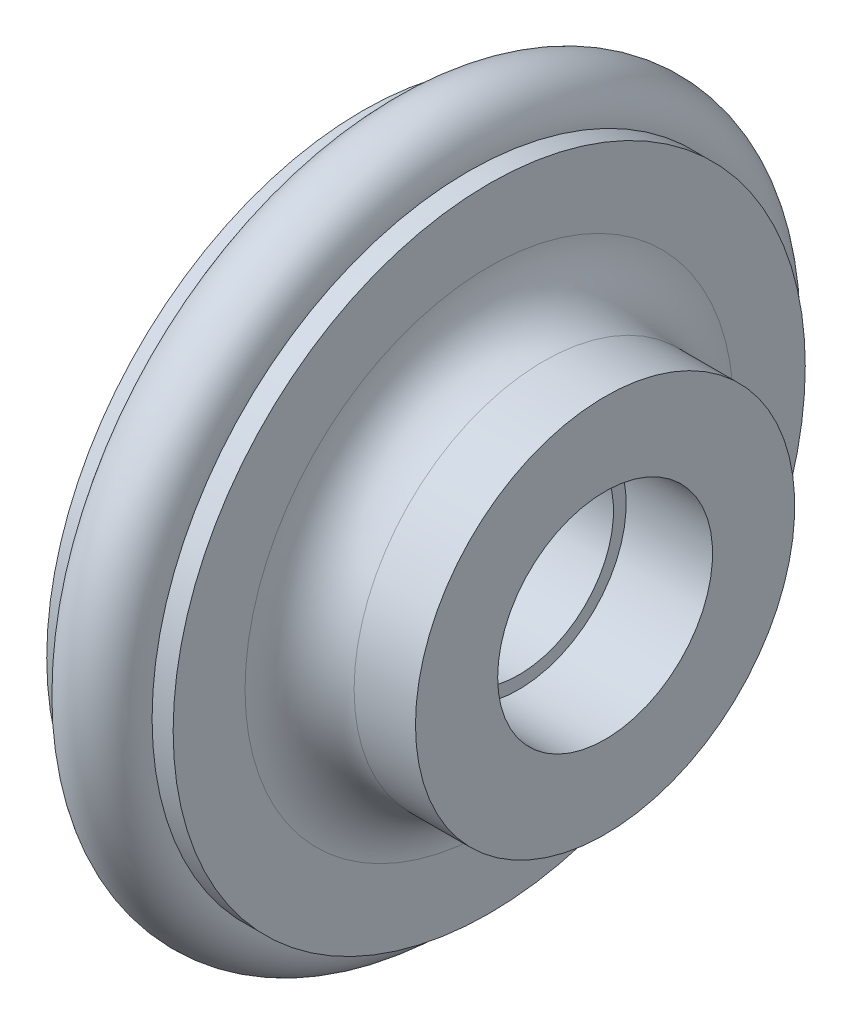
ISO-10303-21;
HEADER;
FILE_DESCRIPTION(('STEP AP214'),'2;1');
FILE_NAME('part.step','',(''),(''),'','','');
FILE_SCHEMA(('AUTOMOTIVE_DESIGN { 1 0 10303 214 1 1 1 1 }'));
ENDSEC;
DATA;
#1=APPLICATION_CONTEXT('core data for automotive mechanical design processes');
#2=APPLICATION_PROTOCOL_DEFINITION('international standard','automotive_design',2000,#1);
#3=PRODUCT_CONTEXT('',#1,'mechanical');
#4=PRODUCT('Part','Part','',(#3));
#5=PRODUCT_RELATED_PRODUCT_CATEGORY('part','',(#4));
#6=PRODUCT_DEFINITION_FORMATION('','',#4);
#7=PRODUCT_DEFINITION_CONTEXT('part definition',#1,'design');
#8=PRODUCT_DEFINITION('design','',#6,#7);
#9=PRODUCT_DEFINITION_SHAPE('','',#8);
#10=(LENGTH_UNIT() NAMED_UNIT(*) SI_UNIT(.MILLI.,.METRE.));
#11=(NAMED_UNIT(*) PLANE_ANGLE_UNIT() SI_UNIT($,.RADIAN.));
#12=(NAMED_UNIT(*) SI_UNIT($,.STERADIAN.) SOLID_ANGLE_UNIT());
#13=UNCERTAINTY_MEASURE_WITH_UNIT(LENGTH_MEASURE(1.E-05),#10,'distance_accuracy_value','');
#14=(GEOMETRIC_REPRESENTATION_CONTEXT(3) GLOBAL_UNCERTAINTY_ASSIGNED_CONTEXT((#13)) GLOBAL_UNIT_ASSIGNED_CONTEXT((#10,
#11,#12)) REPRESENTATION_CONTEXT('',''));
#15=CARTESIAN_POINT('',(0.,0.,0.));
#16=DIRECTION('',(0.,0.,1.));
#17=DIRECTION('',(1.,0.,0.));
#18=AXIS2_PLACEMENT_3D('',#15,#16,#17);
#19=CARTESIAN_POINT('',(0.,0.,0.));
#20=DIRECTION('',(-1.,0.,0.));
#21=DIRECTION('',(0.,0.,1.));
#22=AXIS2_PLACEMENT_3D('',#19,#20,#21);
#23=TOROIDAL_SURFACE('',#22,15.,1.95);
#24=CARTESIAN_POINT('',(0.,0.,16.95));
#25=VERTEX_POINT('',#24);
#26=VERTEX_LOOP('',#25);
#27=FACE_BOUND('',#26,.T.);
#28=ADVANCED_FACE('F41',(#27),#23,.T.);
#29=CLOSED_SHELL('',(#28));
#30=MANIFOLD_SOLID_BREP('B2',#29);
#31=CARTESIAN_POINT('',(0.,0.,0.));
#32=DIRECTION('',(-1.,0.,0.));
#33=DIRECTION('',(0.,0.,1.));
#34=AXIS2_PLACEMENT_3D('',#31,#32,#33);
#35=TOROIDAL_SURFACE('',#34,15.,2.);
#36=CARTESIAN_POINT('',(-2.,0.,0.));
#37=DIRECTION('',(-1.,0.,0.));
#38=DIRECTION('',(0.,0.,1.));
#39=AXIS2_PLACEMENT_3D('',#36,#37,#38);
#40=CIRCLE('',#39,15.);
#41=CARTESIAN_POINT('',(-2.,0.,15.));
#42=VERTEX_POINT('',#41);
#43=EDGE_CURVE('E40',#42,#42,#40,.T.);
#44=ORIENTED_EDGE('',*,*,#43,.F.);
#45=EDGE_LOOP('',(#44));
#46=FACE_BOUND('',#45,.T.);
#47=CARTESIAN_POINT('',(2.,0.,0.));
#48=DIRECTION('',(-1.,0.,0.));
#49=DIRECTION('',(0.,0.,1.));
#50=AXIS2_PLACEMENT_3D('',#47,#48,#49);
#51=CIRCLE('',#50,15.);
#52=CARTESIAN_POINT('',(2.,0.,15.));
#53=VERTEX_POINT('',#52);
#54=EDGE_CURVE('E99',#53,#53,#51,.T.);
#55=ORIENTED_EDGE('',*,*,#54,.T.);
#56=EDGE_LOOP('',(#55));
#57=FACE_BOUND('',#56,.T.);
#58=ADVANCED_FACE('F56',(#46,#57),#35,.F.);
#59=CARTESIAN_POINT('',(0.,0.,0.));
#60=DIRECTION('',(-1.,0.,0.));
#61=DIRECTION('',(0.,0.,1.));
#62=AXIS2_PLACEMENT_3D('',#59,#60,#61);
#63=CYLINDRICAL_SURFACE('',#62,15.);
#64=CARTESIAN_POINT('',(-3.,0.,0.));
#65=DIRECTION('',(-1.,0.,0.));
#66=DIRECTION('',(0.,0.,1.));
#67=AXIS2_PLACEMENT_3D('',#64,#65,#66);
#68=CIRCLE('',#67,15.);
#69=CARTESIAN_POINT('',(-3.,0.,15.));
#70=VERTEX_POINT('',#69);
#71=EDGE_CURVE('E62',#70,#70,#68,.T.);
#72=ORIENTED_EDGE('',*,*,#71,.F.);
#73=EDGE_LOOP('',(#72));
#74=FACE_BOUND('',#73,.T.);
#75=ORIENTED_EDGE('',*,*,#43,.T.);
#76=EDGE_LOOP('',(#75));
#77=FACE_BOUND('',#76,.T.);
#78=ADVANCED_FACE('F166',(#74,#77),#63,.T.);
#79=CARTESIAN_POINT('',(-3.,15.,0.));
#80=DIRECTION('',(1.,0.,0.));
#81=DIRECTION('',(0.,0.,-1.));
#82=AXIS2_PLACEMENT_3D('',#79,#80,#81);
#83=PLANE('',#82);
#84=CARTESIAN_POINT('',(-3.,0.,0.));
#85=DIRECTION('',(-1.,0.,0.));
#86=DIRECTION('',(0.,0.,1.));
#87=AXIS2_PLACEMENT_3D('',#84,#85,#86);
#88=CIRCLE('',#87,5.1);
#89=CARTESIAN_POINT('',(-3.,0.,5.1));
#90=VERTEX_POINT('',#89);
#91=EDGE_CURVE('E66',#90,#90,#88,.T.);
#92=ORIENTED_EDGE('',*,*,#91,.F.);
#93=EDGE_LOOP('',(#92));
#94=FACE_BOUND('',#93,.T.);
#95=ORIENTED_EDGE('',*,*,#71,.T.);
#96=EDGE_LOOP('',(#95));
#97=FACE_BOUND('',#96,.T.);
#98=ADVANCED_FACE('F161',(#94,#97),#83,.F.);
#99=CARTESIAN_POINT('',(0.,0.,0.));
#100=DIRECTION('',(-1.,0.,0.));
#101=DIRECTION('',(0.,0.,1.));
#102=AXIS2_PLACEMENT_3D('',#99,#100,#101);
#103=CYLINDRICAL_SURFACE('',#102,5.1);
#104=CARTESIAN_POINT('',(1.1,0.,0.));
#105=DIRECTION('',(-1.,0.,0.));
#106=DIRECTION('',(0.,0.,1.));
#107=AXIS2_PLACEMENT_3D('',#104,#105,#106);
#108=CIRCLE('',#107,5.1);
#109=CARTESIAN_POINT('',(1.1,0.,5.1));
#110=VERTEX_POINT('',#109);
#111=EDGE_CURVE('E70',#110,#110,#108,.T.);
#112=ORIENTED_EDGE('',*,*,#111,.F.);
#113=EDGE_LOOP('',(#112));
#114=FACE_BOUND('',#113,.T.);
#115=ORIENTED_EDGE('',*,*,#91,.T.);
#116=EDGE_LOOP('',(#115));
#117=FACE_BOUND('',#116,.T.);
#118=ADVANCED_FACE('F155',(#114,#117),#103,.F.);
#119=CARTESIAN_POINT('',(1.1,5.1,0.));
#120=DIRECTION('',(1.,0.,0.));
#121=DIRECTION('',(0.,0.,-1.));
#122=AXIS2_PLACEMENT_3D('',#119,#120,#121);
#123=PLANE('',#122);
#124=CARTESIAN_POINT('',(1.1,0.,0.));
#125=DIRECTION('',(-1.,0.,0.));
#126=DIRECTION('',(0.,0.,1.));
#127=AXIS2_PLACEMENT_3D('',#124,#125,#126);
#128=CIRCLE('',#127,4.5);
#129=CARTESIAN_POINT('',(1.1,0.,4.5));
#130=VERTEX_POINT('',#129);
#131=EDGE_CURVE('E75',#130,#130,#128,.T.);
#132=ORIENTED_EDGE('',*,*,#131,.F.);
#133=EDGE_LOOP('',(#132));
#134=FACE_BOUND('',#133,.T.);
#135=ORIENTED_EDGE('',*,*,#111,.T.);
#136=EDGE_LOOP('',(#135));
#137=FACE_BOUND('',#136,.T.);
#138=ADVANCED_FACE('F149',(#134,#137),#123,.F.);
#139=CARTESIAN_POINT('',(0.,0.,0.));
#140=DIRECTION('',(-1.,0.,0.));
#141=DIRECTION('',(0.,0.,1.));
#142=AXIS2_PLACEMENT_3D('',#139,#140,#141);
#143=CYLINDRICAL_SURFACE('',#142,4.5);
#144=CARTESIAN_POINT('',(4.4,0.,0.));
#145=DIRECTION('',(-1.,0.,0.));
#146=DIRECTION('',(0.,0.,1.));
#147=AXIS2_PLACEMENT_3D('',#144,#145,#146);
#148=CIRCLE('',#147,4.5);
#149=CARTESIAN_POINT('',(4.4,0.,4.5));
#150=VERTEX_POINT('',#149);
#151=EDGE_CURVE('E78',#150,#150,#148,.T.);
#152=ORIENTED_EDGE('',*,*,#151,.F.);
#153=EDGE_LOOP('',(#152));
#154=FACE_BOUND('',#153,.T.);
#155=ORIENTED_EDGE('',*,*,#131,.T.);
#156=EDGE_LOOP('',(#155));
#157=FACE_BOUND('',#156,.T.);
#158=ADVANCED_FACE('F143',(#154,#157),#143,.F.);
#159=CARTESIAN_POINT('',(4.4,5.1,0.));
#160=DIRECTION('',(-1.,0.,0.));
#161=DIRECTION('',(0.,0.,1.));
#162=AXIS2_PLACEMENT_3D('',#159,#160,#161);
#163=PLANE('',#162);
#164=CARTESIAN_POINT('',(4.4,0.,0.));
#165=DIRECTION('',(-1.,0.,0.));
#166=DIRECTION('',(0.,0.,1.));
#167=AXIS2_PLACEMENT_3D('',#164,#165,#166);
#168=CIRCLE('',#167,5.1);
#169=CARTESIAN_POINT('',(4.4,0.,5.1));
#170=VERTEX_POINT('',#169);
#171=EDGE_CURVE('E81',#170,#170,#168,.T.);
#172=ORIENTED_EDGE('',*,*,#171,.F.);
#173=EDGE_LOOP('',(#172));
#174=FACE_BOUND('',#173,.T.);
#175=ORIENTED_EDGE('',*,*,#151,.T.);
#176=EDGE_LOOP('',(#175));
#177=FACE_BOUND('',#176,.T.);
#178=ADVANCED_FACE('F137',(#174,#177),#163,.F.);
#179=CARTESIAN_POINT('',(0.,0.,0.));
#180=DIRECTION('',(-1.,0.,0.));
#181=DIRECTION('',(0.,0.,1.));
#182=AXIS2_PLACEMENT_3D('',#179,#180,#181);
#183=CYLINDRICAL_SURFACE('',#182,5.1);
#184=CARTESIAN_POINT('',(8.5,0.,0.));
#185=DIRECTION('',(-1.,0.,0.));
#186=DIRECTION('',(0.,0.,1.));
#187=AXIS2_PLACEMENT_3D('',#184,#185,#186);
#188=CIRCLE('',#187,5.1);
#189=CARTESIAN_POINT('',(8.5,0.,5.1));
#190=VERTEX_POINT('',#189);
#191=EDGE_CURVE('E84',#190,#190,#188,.T.);
#192=ORIENTED_EDGE('',*,*,#191,.F.);
#193=EDGE_LOOP('',(#192));
#194=FACE_BOUND('',#193,.T.);
#195=ORIENTED_EDGE('',*,*,#171,.T.);
#196=EDGE_LOOP('',(#195));
#197=FACE_BOUND('',#196,.T.);
#198=ADVANCED_FACE('F131',(#194,#197),#183,.F.);
#199=CARTESIAN_POINT('',(8.5,9.,0.));
#200=DIRECTION('',(-1.,0.,0.));
#201=DIRECTION('',(0.,0.,1.));
#202=AXIS2_PLACEMENT_3D('',#199,#200,#201);
#203=PLANE('',#202);
#204=CARTESIAN_POINT('',(8.5,0.,0.));
#205=DIRECTION('',(-1.,0.,0.));
#206=DIRECTION('',(0.,0.,1.));
#207=AXIS2_PLACEMENT_3D('',#204,#205,#206);
#208=CIRCLE('',#207,9.);
#209=CARTESIAN_POINT('',(8.5,0.,9.));
#210=VERTEX_POINT('',#209);
#211=EDGE_CURVE('E87',#210,#210,#208,.T.);
#212=ORIENTED_EDGE('',*,*,#211,.F.);
#213=EDGE_LOOP('',(#212));
#214=FACE_BOUND('',#213,.T.);
#215=ORIENTED_EDGE('',*,*,#191,.T.);
#216=EDGE_LOOP('',(#215));
#217=FACE_BOUND('',#216,.T.);
#218=ADVANCED_FACE('F125',(#214,#217),#203,.F.);
#219=CARTESIAN_POINT('',(0.,0.,0.));
#220=DIRECTION('',(-1.,0.,0.));
#221=DIRECTION('',(0.,0.,1.));
#222=AXIS2_PLACEMENT_3D('',#219,#220,#221);
#223=CYLINDRICAL_SURFACE('',#222,9.);
#224=CARTESIAN_POINT('',(5.58796448278056,0.,0.));
#225=DIRECTION('',(-1.,0.,0.));
#226=DIRECTION('',(0.,0.,1.));
#227=AXIS2_PLACEMENT_3D('',#224,#225,#226);
#228=CIRCLE('',#227,9.);
#229=CARTESIAN_POINT('',(5.58796448278056,0.,9.));
#230=VERTEX_POINT('',#229);
#231=EDGE_CURVE('E90',#230,#230,#228,.T.);
#232=ORIENTED_EDGE('',*,*,#231,.F.);
#233=EDGE_LOOP('',(#232));
#234=FACE_BOUND('',#233,.T.);
#235=ORIENTED_EDGE('',*,*,#211,.T.);
#236=EDGE_LOOP('',(#235));
#237=FACE_BOUND('',#236,.T.);
#238=ADVANCED_FACE('F119',(#234,#237),#223,.T.);
#239=CARTESIAN_POINT('',(5.58796448278056,0.,0.));
#240=DIRECTION('',(-1.,0.,0.));
#241=DIRECTION('',(0.,0.,1.));
#242=AXIS2_PLACEMENT_3D('',#239,#240,#241);
#243=TOROIDAL_SURFACE('',#242,11.5879644827806,2.58796448278056);
#244=CARTESIAN_POINT('',(3.,0.,0.));
#245=DIRECTION('',(-1.,0.,0.));
#246=DIRECTION('',(0.,0.,1.));
#247=AXIS2_PLACEMENT_3D('',#244,#245,#246);
#248=CIRCLE('',#247,11.5879644827806);
#249=CARTESIAN_POINT('',(3.,0.,11.5879644827806));
#250=VERTEX_POINT('',#249);
#251=EDGE_CURVE('E93',#250,#250,#248,.T.);
#252=ORIENTED_EDGE('',*,*,#251,.F.);
#253=EDGE_LOOP('',(#252));
#254=FACE_BOUND('',#253,.T.);
#255=ORIENTED_EDGE('',*,*,#231,.T.);
#256=EDGE_LOOP('',(#255));
#257=FACE_BOUND('',#256,.T.);
#258=ADVANCED_FACE('F113',(#254,#257),#243,.F.);
#259=CARTESIAN_POINT('',(3.,15.,0.));
#260=DIRECTION('',(-1.,0.,0.));
#261=DIRECTION('',(0.,0.,1.));
#262=AXIS2_PLACEMENT_3D('',#259,#260,#261);
#263=PLANE('',#262);
#264=CARTESIAN_POINT('',(3.,0.,0.));
#265=DIRECTION('',(-1.,0.,0.));
#266=DIRECTION('',(0.,0.,1.));
#267=AXIS2_PLACEMENT_3D('',#264,#265,#266);
#268=CIRCLE('',#267,15.);
#269=CARTESIAN_POINT('',(3.,0.,15.));
#270=VERTEX_POINT('',#269);
#271=EDGE_CURVE('E96',#270,#270,#268,.T.);
#272=ORIENTED_EDGE('',*,*,#271,.F.);
#273=EDGE_LOOP('',(#272));
#274=FACE_BOUND('',#273,.T.);
#275=ORIENTED_EDGE('',*,*,#251,.T.);
#276=EDGE_LOOP('',(#275));
#277=FACE_BOUND('',#276,.T.);
#278=ADVANCED_FACE('F107',(#274,#277),#263,.F.);
#279=CARTESIAN_POINT('',(0.,0.,0.));
#280=DIRECTION('',(-1.,0.,0.));
#281=DIRECTION('',(0.,0.,1.));
#282=AXIS2_PLACEMENT_3D('',#279,#280,#281);
#283=CYLINDRICAL_SURFACE('',#282,15.);
#284=ORIENTED_EDGE('',*,*,#54,.F.);
#285=EDGE_LOOP('',(#284));
#286=FACE_BOUND('',#285,.T.);
#287=ORIENTED_EDGE('',*,*,#271,.T.);
#288=EDGE_LOOP('',(#287));
#289=FACE_BOUND('',#288,.T.);
#290=ADVANCED_FACE('F104',(#286,#289),#283,.T.);
#291=CLOSED_SHELL('',(#58,#78,#98,#118,#138,#158,#178,#198,#218,#238,#258,#278,#290));
#292=MANIFOLD_SOLID_BREP('B6',#291);
#293=ADVANCED_BREP_SHAPE_REPRESENTATION('',(#18,#30,#292),#14);
#294=SHAPE_DEFINITION_REPRESENTATION(#9,#293);
ENDSEC;
END-ISO-10303-21;
